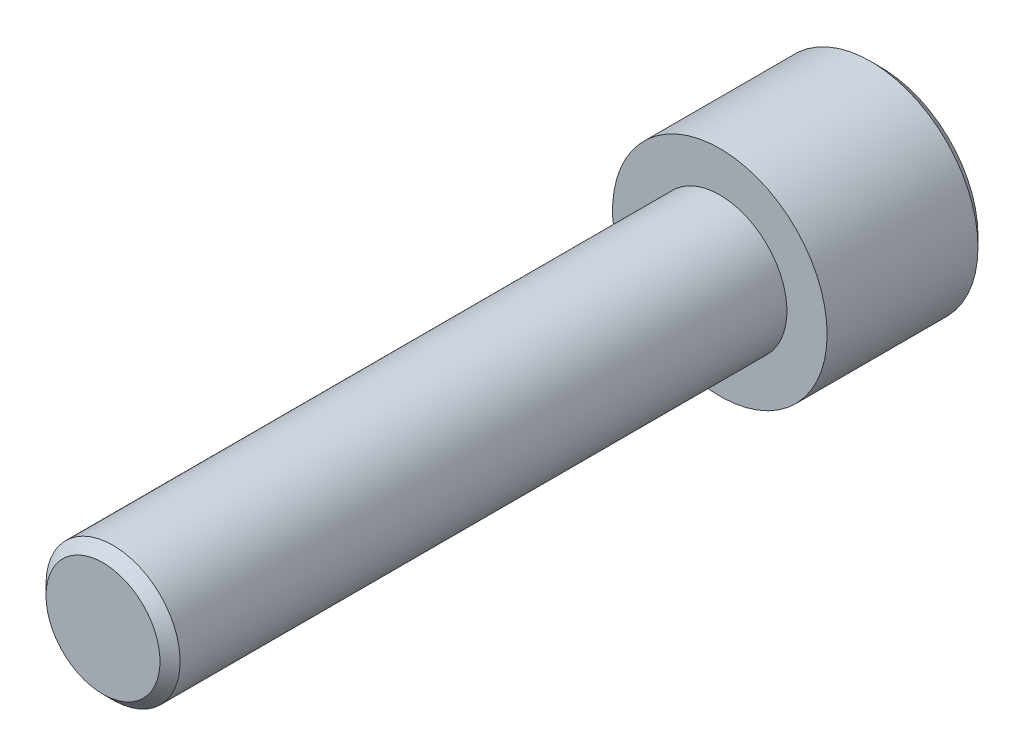
ISO-10303-21;
HEADER;
FILE_DESCRIPTION(('STEP AP214'),'2;1');
FILE_NAME('part.step','',(''),(''),'','','');
FILE_SCHEMA(('AUTOMOTIVE_DESIGN { 1 0 10303 214 1 1 1 1 }'));
ENDSEC;
DATA;
#1=APPLICATION_CONTEXT('core data for automotive mechanical design processes');
#2=APPLICATION_PROTOCOL_DEFINITION('international standard','automotive_design',2000,#1);
#3=PRODUCT_CONTEXT('',#1,'mechanical');
#4=PRODUCT('Part','Part','',(#3));
#5=PRODUCT_RELATED_PRODUCT_CATEGORY('part','',(#4));
#6=PRODUCT_DEFINITION_FORMATION('','',#4);
#7=PRODUCT_DEFINITION_CONTEXT('part definition',#1,'design');
#8=PRODUCT_DEFINITION('design','',#6,#7);
#9=PRODUCT_DEFINITION_SHAPE('','',#8);
#10=(LENGTH_UNIT() NAMED_UNIT(*) SI_UNIT(.MILLI.,.METRE.));
#11=(NAMED_UNIT(*) PLANE_ANGLE_UNIT() SI_UNIT($,.RADIAN.));
#12=(NAMED_UNIT(*) SI_UNIT($,.STERADIAN.) SOLID_ANGLE_UNIT());
#13=UNCERTAINTY_MEASURE_WITH_UNIT(LENGTH_MEASURE(1.E-05),#10,'distance_accuracy_value','');
#14=(GEOMETRIC_REPRESENTATION_CONTEXT(3) GLOBAL_UNCERTAINTY_ASSIGNED_CONTEXT((#13)) GLOBAL_UNIT_ASSIGNED_CONTEXT((#10,
#11,#12)) REPRESENTATION_CONTEXT('',''));
#15=CARTESIAN_POINT('',(0.,0.,0.));
#16=DIRECTION('',(0.,0.,1.));
#17=DIRECTION('',(1.,0.,0.));
#18=AXIS2_PLACEMENT_3D('',#15,#16,#17);
#19=CARTESIAN_POINT('',(-9.33720002000013,-5.4749954,1.7));
#20=DIRECTION('',(0.,0.,1.));
#21=DIRECTION('',(1.,0.,0.));
#22=AXIS2_PLACEMENT_3D('',#19,#20,#21);
#23=PLANE('',#22);
#24=CARTESIAN_POINT('',(-9.33720002000013,-5.4749954,1.69999999997117));
#25=DIRECTION('',(0.,0.,1.));
#26=DIRECTION('',(1.,0.,0.));
#27=AXIS2_PLACEMENT_3D('',#24,#25,#26);
#28=CIRCLE('',#27,0.725000000202675);
#29=CARTESIAN_POINT('',(-8.61220001979746,-5.4749954,1.69999999997117));
#30=VERTEX_POINT('',#29);
#31=EDGE_CURVE('E18',#30,#30,#28,.T.);
#32=ORIENTED_EDGE('',*,*,#31,.F.);
#33=EDGE_LOOP('',(#32));
#34=FACE_BOUND('',#33,.T.);
#35=ADVANCED_FACE('F15',(#34),#23,.F.);
#36=CARTESIAN_POINT('',(-9.33720002000013,-5.4749954,1.77499999995234));
#37=DIRECTION('',(0.,0.,1.));
#38=DIRECTION('',(1.,0.,0.));
#39=AXIS2_PLACEMENT_3D('',#36,#37,#38);
#40=CONICAL_SURFACE('',#39,0.800000000013318,0.78539816226058);
#41=CARTESIAN_POINT('',(-9.33720002000013,-5.4749954,1.775));
#42=DIRECTION('',(0.,0.,1.));
#43=DIRECTION('',(1.,0.,0.));
#44=AXIS2_PLACEMENT_3D('',#41,#42,#43);
#45=CIRCLE('',#44,0.8);
#46=CARTESIAN_POINT('',(-8.53720002000013,-5.4749954,1.775));
#47=VERTEX_POINT('',#46);
#48=EDGE_CURVE('E31',#47,#47,#45,.T.);
#49=ORIENTED_EDGE('',*,*,#48,.F.);
#50=EDGE_LOOP('',(#49));
#51=FACE_BOUND('',#50,.T.);
#52=ORIENTED_EDGE('',*,*,#31,.T.);
#53=EDGE_LOOP('',(#52));
#54=FACE_BOUND('',#53,.T.);
#55=ADVANCED_FACE('F43',(#51,#54),#40,.T.);
#56=CARTESIAN_POINT('',(-9.33720002000013,-5.4749954,7.5));
#57=DIRECTION('',(0.,0.,1.));
#58=DIRECTION('',(1.,0.,0.));
#59=AXIS2_PLACEMENT_3D('',#56,#57,#58);
#60=PLANE('',#59);
#61=CARTESIAN_POINT('',(-9.33720002000013,-5.4749954,7.49999999999318));
#62=DIRECTION('',(0.,0.,-1.));
#63=DIRECTION('',(-1.,0.,0.));
#64=AXIS2_PLACEMENT_3D('',#61,#62,#63);
#65=CIRCLE('',#64,0.425000000020242);
#66=CARTESIAN_POINT('',(-9.76220002002037,-5.4749954,7.49999999999318));
#67=VERTEX_POINT('',#66);
#68=EDGE_CURVE('E33',#67,#67,#65,.T.);
#69=ORIENTED_EDGE('',*,*,#68,.F.);
#70=EDGE_LOOP('',(#69));
#71=FACE_BOUND('',#70,.T.);
#72=ADVANCED_FACE('F50',(#71),#60,.T.);
#73=CARTESIAN_POINT('',(-9.33720002000013,-5.4749954,1.7));
#74=DIRECTION('',(0.,0.,1.));
#75=DIRECTION('',(1.,0.,0.));
#76=AXIS2_PLACEMENT_3D('',#73,#74,#75);
#77=CYLINDRICAL_SURFACE('',#76,0.8);
#78=CARTESIAN_POINT('',(-9.33720002000013,-5.4749954,2.9));
#79=DIRECTION('',(0.,0.,1.));
#80=DIRECTION('',(1.,0.,0.));
#81=AXIS2_PLACEMENT_3D('',#78,#79,#80);
#82=CIRCLE('',#81,0.8);
#83=CARTESIAN_POINT('',(-8.53720002000013,-5.4749954,2.9));
#84=VERTEX_POINT('',#83);
#85=EDGE_CURVE('E27',#84,#84,#82,.T.);
#86=ORIENTED_EDGE('',*,*,#85,.F.);
#87=EDGE_LOOP('',(#86));
#88=FACE_BOUND('',#87,.T.);
#89=ORIENTED_EDGE('',*,*,#48,.T.);
#90=EDGE_LOOP('',(#89));
#91=FACE_BOUND('',#90,.T.);
#92=ADVANCED_FACE('F66',(#88,#91),#77,.T.);
#93=CARTESIAN_POINT('',(-9.33720002000013,-5.4749954,7.42499999995516));
#94=DIRECTION('',(0.,0.,-1.));
#95=DIRECTION('',(-1.,0.,0.));
#96=AXIS2_PLACEMENT_3D('',#93,#94,#95);
#97=CONICAL_SURFACE('',#96,0.499999999944573,0.785398162639542);
#98=ORIENTED_EDGE('',*,*,#68,.T.);
#99=EDGE_LOOP('',(#98));
#100=FACE_BOUND('',#99,.T.);
#101=CARTESIAN_POINT('',(-9.33720002000013,-5.4749954,7.425));
#102=DIRECTION('',(0.,0.,-1.));
#103=DIRECTION('',(-1.,0.,0.));
#104=AXIS2_PLACEMENT_3D('',#101,#102,#103);
#105=CIRCLE('',#104,0.5);
#106=CARTESIAN_POINT('',(-9.83720002000013,-5.4749954,7.425));
#107=VERTEX_POINT('',#106);
#108=EDGE_CURVE('E22',#107,#107,#105,.T.);
#109=ORIENTED_EDGE('',*,*,#108,.F.);
#110=EDGE_LOOP('',(#109));
#111=FACE_BOUND('',#110,.T.);
#112=ADVANCED_FACE('F60',(#100,#111),#97,.T.);
#113=CARTESIAN_POINT('',(-9.33720002000013,-5.4749954,2.9));
#114=DIRECTION('',(0.,0.,1.));
#115=DIRECTION('',(1.,0.,0.));
#116=AXIS2_PLACEMENT_3D('',#113,#114,#115);
#117=PLANE('',#116);
#118=CARTESIAN_POINT('',(-9.33720002000013,-5.4749954,2.9));
#119=DIRECTION('',(0.,0.,-1.));
#120=DIRECTION('',(-1.,0.,0.));
#121=AXIS2_PLACEMENT_3D('',#118,#119,#120);
#122=CIRCLE('',#121,0.5);
#123=CARTESIAN_POINT('',(-9.83720002000013,-5.4749954,2.9));
#124=VERTEX_POINT('',#123);
#125=EDGE_CURVE('E10',#124,#124,#122,.F.);
#126=ORIENTED_EDGE('',*,*,#125,.F.);
#127=EDGE_LOOP('',(#126));
#128=FACE_BOUND('',#127,.T.);
#129=ORIENTED_EDGE('',*,*,#85,.T.);
#130=EDGE_LOOP('',(#129));
#131=FACE_BOUND('',#130,.T.);
#132=ADVANCED_FACE('F54',(#128,#131),#117,.T.);
#133=CARTESIAN_POINT('',(-9.33720002000013,-5.4749954,7.5));
#134=DIRECTION('',(0.,0.,-1.));
#135=DIRECTION('',(-1.,0.,0.));
#136=AXIS2_PLACEMENT_3D('',#133,#134,#135);
#137=CYLINDRICAL_SURFACE('',#136,0.5);
#138=ORIENTED_EDGE('',*,*,#108,.T.);
#139=EDGE_LOOP('',(#138));
#140=FACE_BOUND('',#139,.T.);
#141=ORIENTED_EDGE('',*,*,#125,.T.);
#142=EDGE_LOOP('',(#141));
#143=FACE_BOUND('',#142,.T.);
#144=ADVANCED_FACE('F52',(#140,#143),#137,.T.);
#145=CLOSED_SHELL('',(#35,#55,#72,#92,#112,#132,#144));
#146=MANIFOLD_SOLID_BREP('B1',#145);
#147=ADVANCED_BREP_SHAPE_REPRESENTATION('',(#18,#146),#14);
#148=SHAPE_DEFINITION_REPRESENTATION(#9,#147);
ENDSEC;
END-ISO-10303-21;
